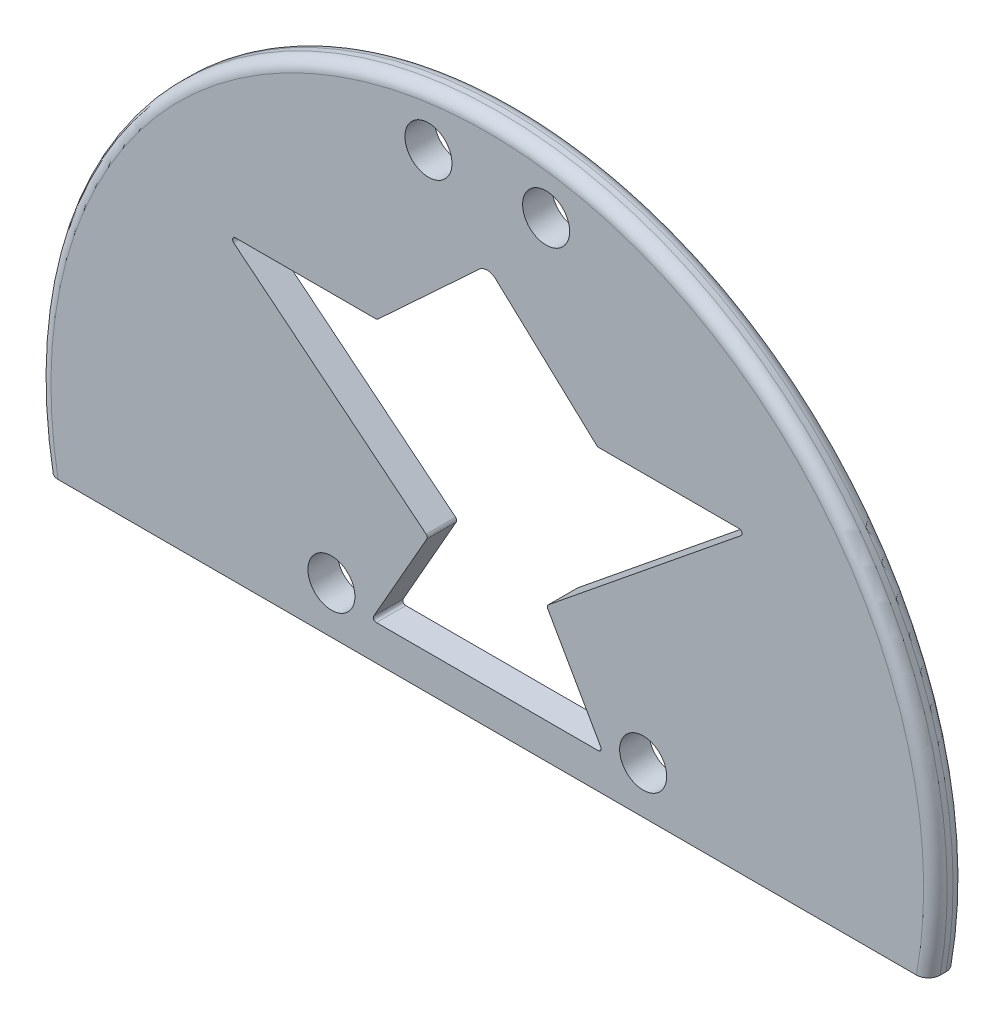
ISO-10303-21;
HEADER;
FILE_DESCRIPTION(('STEP AP214'),'2;1');
FILE_NAME('part.step','',(''),(''),'','','');
FILE_SCHEMA(('AUTOMOTIVE_DESIGN { 1 0 10303 214 1 1 1 1 }'));
ENDSEC;
DATA;
#1=APPLICATION_CONTEXT('core data for automotive mechanical design processes');
#2=APPLICATION_PROTOCOL_DEFINITION('international standard','automotive_design',2000,#1);
#3=PRODUCT_CONTEXT('',#1,'mechanical');
#4=PRODUCT('Part','Part','',(#3));
#5=PRODUCT_RELATED_PRODUCT_CATEGORY('part','',(#4));
#6=PRODUCT_DEFINITION_FORMATION('','',#4);
#7=PRODUCT_DEFINITION_CONTEXT('part definition',#1,'design');
#8=PRODUCT_DEFINITION('design','',#6,#7);
#9=PRODUCT_DEFINITION_SHAPE('','',#8);
#10=(LENGTH_UNIT() NAMED_UNIT(*) SI_UNIT(.MILLI.,.METRE.));
#11=(NAMED_UNIT(*) PLANE_ANGLE_UNIT() SI_UNIT($,.RADIAN.));
#12=(NAMED_UNIT(*) SI_UNIT($,.STERADIAN.) SOLID_ANGLE_UNIT());
#13=UNCERTAINTY_MEASURE_WITH_UNIT(LENGTH_MEASURE(1.E-05),#10,'distance_accuracy_value','');
#14=(GEOMETRIC_REPRESENTATION_CONTEXT(3) GLOBAL_UNCERTAINTY_ASSIGNED_CONTEXT((#13)) GLOBAL_UNIT_ASSIGNED_CONTEXT((#10,
#11,#12)) REPRESENTATION_CONTEXT('',''));
#15=CARTESIAN_POINT('',(0.,0.,0.));
#16=DIRECTION('',(0.,0.,1.));
#17=DIRECTION('',(1.,0.,0.));
#18=AXIS2_PLACEMENT_3D('',#15,#16,#17);
#19=CARTESIAN_POINT('',(0.,13.4283900967621,5.));
#20=DIRECTION('',(0.,0.,-1.));
#21=DIRECTION('',(-1.,0.,0.));
#22=AXIS2_PLACEMENT_3D('',#19,#20,#21);
#23=CYLINDRICAL_SURFACE('',#22,76.1926614615267);
#24=DIRECTION('',(0.,0.,-1.));
#25=VECTOR('',#24,1.);
#26=CARTESIAN_POINT('',(75.,0.,5.));
#27=LINE('',#26,#25);
#28=CARTESIAN_POINT('',(75.,0.,3.));
#29=VERTEX_POINT('',#28);
#30=CARTESIAN_POINT('',(75.,0.,2.));
#31=VERTEX_POINT('',#30);
#32=EDGE_CURVE('E373',#29,#31,#27,.T.);
#33=ORIENTED_EDGE('',*,*,#32,.T.);
#34=CARTESIAN_POINT('',(0.,13.4283900967621,2.));
#35=DIRECTION('',(0.,0.,-1.));
#36=DIRECTION('',(-1.,0.,0.));
#37=AXIS2_PLACEMENT_3D('',#34,#35,#36);
#38=CIRCLE('',#37,76.1926614615267);
#39=CARTESIAN_POINT('',(-75.,0.,2.));
#40=VERTEX_POINT('',#39);
#41=EDGE_CURVE('E383',#31,#40,#38,.F.);
#42=ORIENTED_EDGE('',*,*,#41,.T.);
#43=DIRECTION('',(0.,0.,-1.));
#44=VECTOR('',#43,1.);
#45=CARTESIAN_POINT('',(-75.,0.,5.));
#46=LINE('',#45,#44);
#47=CARTESIAN_POINT('',(-75.,0.,3.));
#48=VERTEX_POINT('',#47);
#49=EDGE_CURVE('E378',#48,#40,#46,.T.);
#50=ORIENTED_EDGE('',*,*,#49,.F.);
#51=CARTESIAN_POINT('',(0.,13.4283900967621,3.));
#52=DIRECTION('',(0.,0.,-1.));
#53=DIRECTION('',(-1.,0.,0.));
#54=AXIS2_PLACEMENT_3D('',#51,#52,#53);
#55=CIRCLE('',#54,76.1926614615267);
#56=EDGE_CURVE('E381',#48,#29,#55,.T.);
#57=ORIENTED_EDGE('',*,*,#56,.T.);
#58=EDGE_LOOP('',(#33,#42,#50,#57));
#59=FACE_BOUND('',#58,.T.);
#60=ADVANCED_FACE('F39',(#59),#23,.T.);
#61=CARTESIAN_POINT('',(-75.,0.,5.));
#62=DIRECTION('',(0.,1.,0.));
#63=DIRECTION('',(0.,0.,1.));
#64=AXIS2_PLACEMENT_3D('',#61,#62,#63);
#65=PLANE('',#64);
#66=ORIENTED_EDGE('',*,*,#49,.T.);
#67=CARTESIAN_POINT('',(-75.,0.,2.));
#68=CARTESIAN_POINT('',(-75.0000000807936,0.,1.94437473360322));
#69=CARTESIAN_POINT('',(-74.9976409515728,0.,1.88877633630942));
#70=CARTESIAN_POINT('',(-74.9882325002566,0.,1.77798223042784));
#71=CARTESIAN_POINT('',(-74.9811835466967,0.,1.72278649054299));
#72=CARTESIAN_POINT('',(-74.9530827056828,0.,1.55854129582627));
#73=CARTESIAN_POINT('',(-74.9250765649443,0.,1.45059985809138));
#74=CARTESIAN_POINT('',(-74.8513662576753,0.,1.24096661260589));
#75=CARTESIAN_POINT('',(-74.8056562414237,0.,1.13927688342937));
#76=CARTESIAN_POINT('',(-74.6979251702693,0.,0.944938573808043));
#77=CARTESIAN_POINT('',(-74.6359049956677,0.,0.852289505785434));
#78=CARTESIAN_POINT('',(-74.4969231902957,0.,0.677959777105565));
#79=CARTESIAN_POINT('',(-74.4198639810298,0.,0.596356984345373));
#80=CARTESIAN_POINT('',(-74.2533038272674,0.,0.447001640345716));
#81=CARTESIAN_POINT('',(-74.1638001730127,0.,0.379252113592567));
#82=CARTESIAN_POINT('',(-73.9734806801513,0.,0.258457536583111));
#83=CARTESIAN_POINT('',(-73.8725151149175,0.,0.20564865067165));
#84=CARTESIAN_POINT('',(-73.6632534202069,0.,0.11746849122814));
#85=CARTESIAN_POINT('',(-73.5549598844654,0.,0.0820910841624064));
#86=CARTESIAN_POINT('',(-73.3663898836883,0.,0.0372985743339663));
#87=CARTESIAN_POINT('',(-73.2871650798922,0.,0.0233190325615237));
#88=CARTESIAN_POINT('',(-73.1277417984286,0.,0.0046701170815256));
#89=CARTESIAN_POINT('',(-73.0475448701878,0.,-1.25034629829377E-05));
#90=CARTESIAN_POINT('',(-72.967317027241,0.,0.));
#91=B_SPLINE_CURVE_WITH_KNOTS('',3,(#67,#68,#69,#70,#71,#72,#73,#74,#75,#76,#77,#78,#79,#80,#81,
#82,#83,#84,#85,#86,#87,#88,#89,#90),.UNSPECIFIED.,.F.,.F.,(4,2,2,2,2,2,2,2,2,2,2,4),(0.,
0.166772542538005,0.333531981314523,0.666357835634245,0.999293756342944,1.33221171133097,
1.66736622938711,2.00259384143326,2.34285694844844,2.68300024300966,2.92383033004541,
3.16431702028172),.UNSPECIFIED.);
#92=CARTESIAN_POINT('',(-72.967317027241,0.,0.));
#93=VERTEX_POINT('',#92);
#94=EDGE_CURVE('E413',#40,#93,#91,.T.);
#95=ORIENTED_EDGE('',*,*,#94,.T.);
#96=DIRECTION('',(1.,0.,0.));
#97=VECTOR('',#96,1.);
#98=CARTESIAN_POINT('',(-75.,0.,0.));
#99=LINE('',#98,#97);
#100=CARTESIAN_POINT('',(72.967317027241,0.,0.));
#101=VERTEX_POINT('',#100);
#102=EDGE_CURVE('E350',#93,#101,#99,.T.);
#103=ORIENTED_EDGE('',*,*,#102,.T.);
#104=CARTESIAN_POINT('',(72.967317027241,0.,0.));
#105=CARTESIAN_POINT('',(73.0252058663371,0.,8.94658172851899E-07));
#106=CARTESIAN_POINT('',(73.0830672872238,0.,0.0024324924788198));
#107=CARTESIAN_POINT('',(73.1983818272335,0.,0.012137730152485));
#108=CARTESIAN_POINT('',(73.255834950811,0.,0.0194113170974663));
#109=CARTESIAN_POINT('',(73.4269214130844,0.,0.0484436659315943));
#110=CARTESIAN_POINT('',(73.5394175423327,0.,0.0774141203938929));
#111=CARTESIAN_POINT('',(73.7579583662471,0.,0.153869250513778));
#112=CARTESIAN_POINT('',(73.8639987336327,0.,0.201366189848063));
#113=CARTESIAN_POINT('',(74.066497163907,0.,0.313619524621708));
#114=CARTESIAN_POINT('',(74.1629582935991,0.,0.378370371591788));
#115=CARTESIAN_POINT('',(74.342697243322,0.,0.522797535821646));
#116=CARTESIAN_POINT('',(74.4260745825831,0.,0.602349994919452));
#117=CARTESIAN_POINT('',(74.5780538956178,0.,0.774542249128223));
#118=CARTESIAN_POINT('',(74.6466534703985,0.,0.867184165119394));
#119=CARTESIAN_POINT('',(74.7659798335164,0.,1.06137723220373));
#120=CARTESIAN_POINT('',(74.8169636488227,0.,1.16277065950621));
#121=CARTESIAN_POINT('',(74.9008756599046,0.,1.37273300241403));
#122=CARTESIAN_POINT('',(74.9338185752605,0.,1.48129598707995));
#123=CARTESIAN_POINT('',(74.9714465993115,0.,1.65890185858043));
#124=CARTESIAN_POINT('',(74.9821480681298,0.,1.72672712899801));
#125=CARTESIAN_POINT('',(74.9964228577847,0.,1.86302440380287));
#126=CARTESIAN_POINT('',(75.0000064482573,0.,1.93149533301149));
#127=CARTESIAN_POINT('',(75.,0.,2.));
#128=B_SPLINE_CURVE_WITH_KNOTS('',3,(#104,#105,#106,#107,#108,#109,#110,#111,#112,#113,#114,
#115,#116,#117,#118,#119,#120,#121,#122,#123,#124,#125,#126,#127),.UNSPECIFIED.,.F.,.F.,(4,2,2,
2,2,2,2,2,2,2,2,4),(0.,0.17356080760957,0.347119718764882,0.69383558549081,1.040781352658,
1.38761568422101,1.73166859802616,2.07577732267278,2.41462921521817,2.75320422484968,
2.95885559472801,3.16421003578057),.UNSPECIFIED.);
#129=EDGE_CURVE('E408',#101,#31,#128,.T.);
#130=ORIENTED_EDGE('',*,*,#129,.T.);
#131=ORIENTED_EDGE('',*,*,#32,.F.);
#132=CARTESIAN_POINT('',(75.,0.,3.));
#133=CARTESIAN_POINT('',(75.0000000807936,0.,3.05562526639678));
#134=CARTESIAN_POINT('',(74.9976409515728,0.,3.11122366369058));
#135=CARTESIAN_POINT('',(74.9882325002566,0.,3.22201776957216));
#136=CARTESIAN_POINT('',(74.9811835466967,0.,3.27721350945701));
#137=CARTESIAN_POINT('',(74.9530827056828,0.,3.44145870417373));
#138=CARTESIAN_POINT('',(74.9250765649443,0.,3.54940014190862));
#139=CARTESIAN_POINT('',(74.8513662576753,0.,3.75903338739411));
#140=CARTESIAN_POINT('',(74.8056562414237,0.,3.86072311657063));
#141=CARTESIAN_POINT('',(74.6979251702693,0.,4.05506142619196));
#142=CARTESIAN_POINT('',(74.6359049956677,0.,4.14771049421457));
#143=CARTESIAN_POINT('',(74.4969231902957,0.,4.32204022289444));
#144=CARTESIAN_POINT('',(74.4198639810298,0.,4.40364301565463));
#145=CARTESIAN_POINT('',(74.2533038272674,0.,4.55299835965428));
#146=CARTESIAN_POINT('',(74.1638001730127,0.,4.62074788640743));
#147=CARTESIAN_POINT('',(73.9734806801513,0.,4.74154246341689));
#148=CARTESIAN_POINT('',(73.8725151149175,0.,4.79435134932835));
#149=CARTESIAN_POINT('',(73.6632534202069,0.,4.88253150877186));
#150=CARTESIAN_POINT('',(73.5549598844654,0.,4.91790891583759));
#151=CARTESIAN_POINT('',(73.3663898836883,0.,4.96270142566603));
#152=CARTESIAN_POINT('',(73.2871650798922,0.,4.97668096743848));
#153=CARTESIAN_POINT('',(73.1277417984286,0.,4.99532988291847));
#154=CARTESIAN_POINT('',(73.0475448701878,0.,5.00001250346298));
#155=CARTESIAN_POINT('',(72.967317027241,0.,5.));
#156=B_SPLINE_CURVE_WITH_KNOTS('',3,(#132,#133,#134,#135,#136,#137,#138,#139,#140,#141,#142,
#143,#144,#145,#146,#147,#148,#149,#150,#151,#152,#153,#154,#155),.UNSPECIFIED.,.F.,.F.,(4,2,2,
2,2,2,2,2,2,2,2,4),(0.,0.166772542538005,0.333531981314524,0.666357835634245,0.999293756342944,
1.33221171133097,1.66736622938711,2.00259384143326,2.34285694844844,2.68300024300966,
2.92383033004541,3.16431702028172),.UNSPECIFIED.);
#157=CARTESIAN_POINT('',(72.967317027241,0.,5.));
#158=VERTEX_POINT('',#157);
#159=EDGE_CURVE('E55',#29,#158,#156,.T.);
#160=ORIENTED_EDGE('',*,*,#159,.T.);
#161=DIRECTION('',(1.,0.,0.));
#162=VECTOR('',#161,1.);
#163=CARTESIAN_POINT('',(-75.,0.,5.));
#164=LINE('',#163,#162);
#165=CARTESIAN_POINT('',(-72.967317027241,0.,5.));
#166=VERTEX_POINT('',#165);
#167=EDGE_CURVE('E371',#166,#158,#164,.T.);
#168=ORIENTED_EDGE('',*,*,#167,.F.);
#169=CARTESIAN_POINT('',(-72.967317027241,0.,5.));
#170=CARTESIAN_POINT('',(-73.0252058663371,0.,4.99999910534183));
#171=CARTESIAN_POINT('',(-73.0830672872238,0.,4.99756750752118));
#172=CARTESIAN_POINT('',(-73.1983818272335,0.,4.98786226984751));
#173=CARTESIAN_POINT('',(-73.255834950811,0.,4.98058868290253));
#174=CARTESIAN_POINT('',(-73.4269214130844,0.,4.95155633406841));
#175=CARTESIAN_POINT('',(-73.5394175423327,0.,4.92258587960611));
#176=CARTESIAN_POINT('',(-73.7579583662471,0.,4.84613074948622));
#177=CARTESIAN_POINT('',(-73.8639987336327,0.,4.79863381015194));
#178=CARTESIAN_POINT('',(-74.066497163907,0.,4.6863804753783));
#179=CARTESIAN_POINT('',(-74.1629582935991,0.,4.62162962840822));
#180=CARTESIAN_POINT('',(-74.342697243322,0.,4.47720246417836));
#181=CARTESIAN_POINT('',(-74.4260745825831,0.,4.39765000508055));
#182=CARTESIAN_POINT('',(-74.5780538956178,0.,4.22545775087178));
#183=CARTESIAN_POINT('',(-74.6466534703985,0.,4.13281583488061));
#184=CARTESIAN_POINT('',(-74.7659798335164,0.,3.93862276779627));
#185=CARTESIAN_POINT('',(-74.8169636488227,0.,3.83722934049379));
#186=CARTESIAN_POINT('',(-74.9008756599046,0.,3.62726699758597));
#187=CARTESIAN_POINT('',(-74.9338185752605,0.,3.51870401292005));
#188=CARTESIAN_POINT('',(-74.9714465993115,0.,3.34109814141957));
#189=CARTESIAN_POINT('',(-74.9821480681298,0.,3.27327287100199));
#190=CARTESIAN_POINT('',(-74.9964228577847,0.,3.13697559619713));
#191=CARTESIAN_POINT('',(-75.0000064482573,0.,3.06850466698851));
#192=CARTESIAN_POINT('',(-75.,0.,3.));
#193=B_SPLINE_CURVE_WITH_KNOTS('',3,(#169,#170,#171,#172,#173,#174,#175,#176,#177,#178,#179,
#180,#181,#182,#183,#184,#185,#186,#187,#188,#189,#190,#191,#192),.UNSPECIFIED.,.F.,.F.,(4,2,2,
2,2,2,2,2,2,2,2,4),(0.,0.17356080760957,0.347119718764882,0.693835585490809,1.040781352658,
1.38761568422099,1.73166859802616,2.07577732267278,2.41462921521818,2.75320422484968,
2.95885559472802,3.16421003578057),.UNSPECIFIED.);
#194=EDGE_CURVE('E63',#166,#48,#193,.T.);
#195=ORIENTED_EDGE('',*,*,#194,.T.);
#196=EDGE_LOOP('',(#66,#95,#103,#130,#131,#160,#168,#195));
#197=FACE_BOUND('',#196,.T.);
#198=ADVANCED_FACE('F397',(#197),#65,.F.);
#199=CARTESIAN_POINT('',(0.,13.4283900967621,5.));
#200=DIRECTION('',(0.,0.,-1.));
#201=DIRECTION('',(-1.,0.,0.));
#202=AXIS2_PLACEMENT_3D('',#199,#200,#201);
#203=PLANE('',#202);
#204=DIRECTION('',(-1.,0.,0.));
#205=VECTOR('',#204,1.);
#206=CARTESIAN_POINT('',(-42.8034018001975,50.6674536340166,5.));
#207=LINE('',#206,#205);
#208=CARTESIAN_POINT('',(-18.9455402336368,50.6674536340166,5.));
#209=VERTEX_POINT('',#208);
#210=CARTESIAN_POINT('',(-42.8034018001975,50.6674536340166,5.));
#211=VERTEX_POINT('',#210);
#212=EDGE_CURVE('E267',#209,#211,#207,.T.);
#213=ORIENTED_EDGE('',*,*,#212,.F.);
#214=CARTESIAN_POINT('',(-18.9455402336368,51.1674536340166,5.));
#215=DIRECTION('',(0.,0.,-1.));
#216=DIRECTION('',(1.,0.,0.));
#217=AXIS2_PLACEMENT_3D('',#214,#215,#216);
#218=CIRCLE('',#217,0.499999999999991);
#219=CARTESIAN_POINT('',(-18.6057993792613,50.8006074102821,5.));
#220=VERTEX_POINT('',#219);
#221=EDGE_CURVE('E198',#220,#209,#218,.T.);
#222=ORIENTED_EDGE('',*,*,#221,.F.);
#223=DIRECTION('',(-0.73369244746886,-0.679481708750981,0.));
#224=VECTOR('',#223,1.);
#225=CARTESIAN_POINT('',(-18.6057993792613,50.8006074102821,5.));
#226=LINE('',#225,#224);
#227=CARTESIAN_POINT('',(-1.35896341750195,66.7731168865249,5.));
#228=VERTEX_POINT('',#227);
#229=EDGE_CURVE('E217',#228,#220,#226,.T.);
#230=ORIENTED_EDGE('',*,*,#229,.F.);
#231=CARTESIAN_POINT('',(0.,65.3057319915872,5.));
#232=DIRECTION('',(0.,0.,1.));
#233=DIRECTION('',(-1.,0.,0.));
#234=AXIS2_PLACEMENT_3D('',#231,#232,#233);
#235=CIRCLE('',#234,1.99999999999998);
#236=CARTESIAN_POINT('',(1.35896341750195,66.7731168865249,5.));
#237=VERTEX_POINT('',#236);
#238=EDGE_CURVE('E220',#237,#228,#235,.T.);
#239=ORIENTED_EDGE('',*,*,#238,.F.);
#240=DIRECTION('',(-0.73369244746886,0.679481708750981,0.));
#241=VECTOR('',#240,1.);
#242=CARTESIAN_POINT('',(18.6057993792613,50.8006074102821,5.));
#243=LINE('',#242,#241);
#244=CARTESIAN_POINT('',(18.6057993792613,50.8006074102821,5.));
#245=VERTEX_POINT('',#244);
#246=EDGE_CURVE('E308',#245,#237,#243,.T.);
#247=ORIENTED_EDGE('',*,*,#246,.F.);
#248=CARTESIAN_POINT('',(18.9455402336368,51.1674536340166,5.));
#249=DIRECTION('',(0.,0.,-1.));
#250=DIRECTION('',(-1.,0.,0.));
#251=AXIS2_PLACEMENT_3D('',#248,#249,#250);
#252=CIRCLE('',#251,0.499999999999991);
#253=CARTESIAN_POINT('',(18.9455402336368,50.6674536340166,5.));
#254=VERTEX_POINT('',#253);
#255=EDGE_CURVE('E305',#254,#245,#252,.T.);
#256=ORIENTED_EDGE('',*,*,#255,.F.);
#257=DIRECTION('',(-1.,0.,0.));
#258=VECTOR('',#257,1.);
#259=CARTESIAN_POINT('',(42.8034018001975,50.6674536340166,5.));
#260=LINE('',#259,#258);
#261=CARTESIAN_POINT('',(42.8034018001975,50.6674536340165,5.));
#262=VERTEX_POINT('',#261);
#263=EDGE_CURVE('E302',#262,#254,#260,.T.);
#264=ORIENTED_EDGE('',*,*,#263,.F.);
#265=CARTESIAN_POINT('',(42.8034018001975,50.1674536340165,5.));
#266=DIRECTION('',(0.,0.,1.));
#267=DIRECTION('',(1.,0.,0.));
#268=AXIS2_PLACEMENT_3D('',#265,#266,#267);
#269=CIRCLE('',#268,0.500000000000004);
#270=CARTESIAN_POINT('',(43.1183027794081,49.7790757596568,5.));
#271=VERTEX_POINT('',#270);
#272=EDGE_CURVE('E299',#271,#262,#269,.T.);
#273=ORIENTED_EDGE('',*,*,#272,.F.);
#274=DIRECTION('',(0.776755748719506,0.629801958421216,0.));
#275=VECTOR('',#274,1.);
#276=CARTESIAN_POINT('',(10.3870609475926,23.240231031158,5.));
#277=LINE('',#276,#275);
#278=CARTESIAN_POINT('',(10.3870609475926,23.240231031158,5.));
#279=VERTEX_POINT('',#278);
#280=EDGE_CURVE('E296',#279,#271,#277,.T.);
#281=ORIENTED_EDGE('',*,*,#280,.F.);
#282=CARTESIAN_POINT('',(10.7019619268032,22.8518531567982,5.));
#283=DIRECTION('',(0.,0.,-1.));
#284=DIRECTION('',(-1.,0.,0.));
#285=AXIS2_PLACEMENT_3D('',#282,#283,#284);
#286=CIRCLE('',#285,0.499999999999995);
#287=CARTESIAN_POINT('',(10.2675082132739,22.6043658423748,5.));
#288=VERTEX_POINT('',#287);
#289=EDGE_CURVE('E293',#288,#279,#286,.T.);
#290=ORIENTED_EDGE('',*,*,#289,.F.);
#291=DIRECTION('',(-0.494974628846904,0.868907427058757,0.));
#292=VECTOR('',#291,1.);
#293=CARTESIAN_POINT('',(19.3023212585952,6.74412634796789,5.));
#294=LINE('',#293,#292);
#295=CARTESIAN_POINT('',(19.3023212585952,6.74412634796789,5.));
#296=VERTEX_POINT('',#295);
#297=EDGE_CURVE('E290',#296,#288,#294,.T.);
#298=ORIENTED_EDGE('',*,*,#297,.F.);
#299=CARTESIAN_POINT('',(18.8678675450658,6.49663903354443,5.));
#300=DIRECTION('',(0.,0.,1.));
#301=DIRECTION('',(1.,0.,0.));
#302=AXIS2_PLACEMENT_3D('',#299,#300,#301);
#303=CIRCLE('',#302,0.500000000000005);
#304=CARTESIAN_POINT('',(18.8678675450658,5.99663903354443,5.));
#305=VERTEX_POINT('',#304);
#306=EDGE_CURVE('E287',#305,#296,#303,.T.);
#307=ORIENTED_EDGE('',*,*,#306,.F.);
#308=DIRECTION('',(1.,0.,0.));
#309=VECTOR('',#308,1.);
#310=CARTESIAN_POINT('',(18.8678675450658,5.99663903354443,5.));
#311=LINE('',#310,#309);
#312=CARTESIAN_POINT('',(-18.8678675450658,5.99663903354443,5.));
#313=VERTEX_POINT('',#312);
#314=EDGE_CURVE('E284',#313,#305,#311,.T.);
#315=ORIENTED_EDGE('',*,*,#314,.F.);
#316=CARTESIAN_POINT('',(-18.8678675450658,6.49663903354443,5.));
#317=DIRECTION('',(0.,0.,1.));
#318=DIRECTION('',(-1.,0.,0.));
#319=AXIS2_PLACEMENT_3D('',#316,#317,#318);
#320=CIRCLE('',#319,0.500000000000005);
#321=CARTESIAN_POINT('',(-19.3023212585952,6.74412634796789,5.));
#322=VERTEX_POINT('',#321);
#323=EDGE_CURVE('E281',#322,#313,#320,.T.);
#324=ORIENTED_EDGE('',*,*,#323,.F.);
#325=DIRECTION('',(-0.494974628846904,-0.868907427058757,0.));
#326=VECTOR('',#325,1.);
#327=CARTESIAN_POINT('',(-19.3023212585952,6.74412634796789,5.));
#328=LINE('',#327,#326);
#329=CARTESIAN_POINT('',(-10.2675082132739,22.6043658423748,5.));
#330=VERTEX_POINT('',#329);
#331=EDGE_CURVE('E278',#330,#322,#328,.T.);
#332=ORIENTED_EDGE('',*,*,#331,.F.);
#333=CARTESIAN_POINT('',(-10.7019619268032,22.8518531567982,5.));
#334=DIRECTION('',(0.,0.,-1.));
#335=DIRECTION('',(1.,0.,0.));
#336=AXIS2_PLACEMENT_3D('',#333,#334,#335);
#337=CIRCLE('',#336,0.499999999999995);
#338=CARTESIAN_POINT('',(-10.3870609475926,23.240231031158,5.));
#339=VERTEX_POINT('',#338);
#340=EDGE_CURVE('E275',#339,#330,#337,.T.);
#341=ORIENTED_EDGE('',*,*,#340,.F.);
#342=DIRECTION('',(0.776755748719506,-0.629801958421216,0.));
#343=VECTOR('',#342,1.);
#344=CARTESIAN_POINT('',(-10.3870609475926,23.240231031158,5.));
#345=LINE('',#344,#343);
#346=CARTESIAN_POINT('',(-43.1183027794081,49.7790757596568,5.));
#347=VERTEX_POINT('',#346);
#348=EDGE_CURVE('E272',#347,#339,#345,.T.);
#349=ORIENTED_EDGE('',*,*,#348,.F.);
#350=CARTESIAN_POINT('',(-42.8034018001975,50.1674536340165,5.));
#351=DIRECTION('',(0.,0.,1.));
#352=DIRECTION('',(-1.,0.,0.));
#353=AXIS2_PLACEMENT_3D('',#350,#351,#352);
#354=CIRCLE('',#353,0.500000000000004);
#355=EDGE_CURVE('E269',#211,#347,#354,.T.);
#356=ORIENTED_EDGE('',*,*,#355,.F.);
#357=EDGE_LOOP('',(#213,#222,#230,#239,#247,#256,#264,#273,#281,#290,#298,#307,#315,#324,#332,
#341,#349,#356));
#358=FACE_BOUND('',#357,.T.);
#359=CARTESIAN_POINT('',(26.5,7.99999999999999,5.));
#360=DIRECTION('',(0.,0.,1.));
#361=DIRECTION('',(1.,0.,0.));
#362=AXIS2_PLACEMENT_3D('',#359,#360,#361);
#363=CIRCLE('',#362,4.);
#364=CARTESIAN_POINT('',(30.5,7.99999999999999,5.));
#365=VERTEX_POINT('',#364);
#366=EDGE_CURVE('E351',#365,#365,#363,.T.);
#367=ORIENTED_EDGE('',*,*,#366,.F.);
#368=EDGE_LOOP('',(#367));
#369=FACE_BOUND('',#368,.T.);
#370=CARTESIAN_POINT('',(10.,80.,5.));
#371=DIRECTION('',(0.,0.,1.));
#372=DIRECTION('',(1.,0.,0.));
#373=AXIS2_PLACEMENT_3D('',#370,#371,#372);
#374=CIRCLE('',#373,4.00000000000001);
#375=CARTESIAN_POINT('',(14.,80.,5.));
#376=VERTEX_POINT('',#375);
#377=EDGE_CURVE('E357',#376,#376,#374,.T.);
#378=ORIENTED_EDGE('',*,*,#377,.F.);
#379=EDGE_LOOP('',(#378));
#380=FACE_BOUND('',#379,.T.);
#381=CARTESIAN_POINT('',(-10.,80.,5.));
#382=DIRECTION('',(0.,0.,1.));
#383=DIRECTION('',(-1.,0.,0.));
#384=AXIS2_PLACEMENT_3D('',#381,#382,#383);
#385=CIRCLE('',#384,4.00000000000001);
#386=CARTESIAN_POINT('',(-14.,80.,5.));
#387=VERTEX_POINT('',#386);
#388=EDGE_CURVE('E363',#387,#387,#385,.T.);
#389=ORIENTED_EDGE('',*,*,#388,.F.);
#390=EDGE_LOOP('',(#389));
#391=FACE_BOUND('',#390,.T.);
#392=CARTESIAN_POINT('',(-26.5,7.99999999999998,5.));
#393=DIRECTION('',(0.,0.,1.));
#394=DIRECTION('',(-1.,0.,0.));
#395=AXIS2_PLACEMENT_3D('',#392,#393,#394);
#396=CIRCLE('',#395,4.);
#397=CARTESIAN_POINT('',(-30.5,7.99999999999998,5.));
#398=VERTEX_POINT('',#397);
#399=EDGE_CURVE('E315',#398,#398,#396,.T.);
#400=ORIENTED_EDGE('',*,*,#399,.F.);
#401=EDGE_LOOP('',(#400));
#402=FACE_BOUND('',#401,.T.);
#403=ORIENTED_EDGE('',*,*,#167,.T.);
#404=CARTESIAN_POINT('',(0.,13.4283900967621,5.));
#405=DIRECTION('',(0.,0.,-1.));
#406=DIRECTION('',(-1.,0.,0.));
#407=AXIS2_PLACEMENT_3D('',#404,#405,#406);
#408=CIRCLE('',#407,74.1926614615267);
#409=EDGE_CURVE('E11',#158,#166,#408,.F.);
#410=ORIENTED_EDGE('',*,*,#409,.T.);
#411=EDGE_LOOP('',(#403,#410));
#412=FACE_BOUND('',#411,.T.);
#413=ADVANCED_FACE('F402',(#358,#369,#380,#391,#402,#412),#203,.F.);
#414=CARTESIAN_POINT('',(0.,13.4283900967621,0.));
#415=DIRECTION('',(0.,0.,-1.));
#416=DIRECTION('',(-1.,0.,0.));
#417=AXIS2_PLACEMENT_3D('',#414,#415,#416);
#418=PLANE('',#417);
#419=CARTESIAN_POINT('',(-18.9455402336368,51.1674536340166,0.));
#420=DIRECTION('',(0.,0.,-1.));
#421=DIRECTION('',(1.,0.,0.));
#422=AXIS2_PLACEMENT_3D('',#419,#420,#421);
#423=CIRCLE('',#422,0.499999999999991);
#424=CARTESIAN_POINT('',(-18.6057993792613,50.8006074102821,0.));
#425=VERTEX_POINT('',#424);
#426=CARTESIAN_POINT('',(-18.9455402336368,50.6674536340166,0.));
#427=VERTEX_POINT('',#426);
#428=EDGE_CURVE('E195',#425,#427,#423,.T.);
#429=ORIENTED_EDGE('',*,*,#428,.T.);
#430=DIRECTION('',(-1.,0.,0.));
#431=VECTOR('',#430,1.);
#432=CARTESIAN_POINT('',(-42.8034018001975,50.6674536340166,0.));
#433=LINE('',#432,#431);
#434=CARTESIAN_POINT('',(-42.8034018001975,50.6674536340166,0.));
#435=VERTEX_POINT('',#434);
#436=EDGE_CURVE('E207',#427,#435,#433,.T.);
#437=ORIENTED_EDGE('',*,*,#436,.T.);
#438=CARTESIAN_POINT('',(-42.8034018001975,50.1674536340165,0.));
#439=DIRECTION('',(0.,0.,1.));
#440=DIRECTION('',(-1.,0.,0.));
#441=AXIS2_PLACEMENT_3D('',#438,#439,#440);
#442=CIRCLE('',#441,0.500000000000004);
#443=CARTESIAN_POINT('',(-43.1183027794081,49.7790757596568,0.));
#444=VERTEX_POINT('',#443);
#445=EDGE_CURVE('E211',#435,#444,#442,.T.);
#446=ORIENTED_EDGE('',*,*,#445,.T.);
#447=DIRECTION('',(0.776755748719506,-0.629801958421216,0.));
#448=VECTOR('',#447,1.);
#449=CARTESIAN_POINT('',(-10.3870609475926,23.240231031158,0.));
#450=LINE('',#449,#448);
#451=CARTESIAN_POINT('',(-10.3870609475926,23.240231031158,0.));
#452=VERTEX_POINT('',#451);
#453=EDGE_CURVE('E224',#444,#452,#450,.T.);
#454=ORIENTED_EDGE('',*,*,#453,.T.);
#455=CARTESIAN_POINT('',(-10.7019619268032,22.8518531567982,0.));
#456=DIRECTION('',(0.,0.,-1.));
#457=DIRECTION('',(1.,0.,0.));
#458=AXIS2_PLACEMENT_3D('',#455,#456,#457);
#459=CIRCLE('',#458,0.499999999999995);
#460=CARTESIAN_POINT('',(-10.2675082132739,22.6043658423748,0.));
#461=VERTEX_POINT('',#460);
#462=EDGE_CURVE('E227',#452,#461,#459,.T.);
#463=ORIENTED_EDGE('',*,*,#462,.T.);
#464=DIRECTION('',(-0.494974628846904,-0.868907427058757,0.));
#465=VECTOR('',#464,1.);
#466=CARTESIAN_POINT('',(-19.3023212585952,6.74412634796789,0.));
#467=LINE('',#466,#465);
#468=CARTESIAN_POINT('',(-19.3023212585952,6.74412634796789,0.));
#469=VERTEX_POINT('',#468);
#470=EDGE_CURVE('E230',#461,#469,#467,.T.);
#471=ORIENTED_EDGE('',*,*,#470,.T.);
#472=CARTESIAN_POINT('',(-18.8678675450658,6.49663903354443,0.));
#473=DIRECTION('',(0.,0.,1.));
#474=DIRECTION('',(-1.,0.,0.));
#475=AXIS2_PLACEMENT_3D('',#472,#473,#474);
#476=CIRCLE('',#475,0.500000000000005);
#477=CARTESIAN_POINT('',(-18.8678675450658,5.99663903354443,0.));
#478=VERTEX_POINT('',#477);
#479=EDGE_CURVE('E233',#469,#478,#476,.T.);
#480=ORIENTED_EDGE('',*,*,#479,.T.);
#481=DIRECTION('',(1.,0.,0.));
#482=VECTOR('',#481,1.);
#483=CARTESIAN_POINT('',(18.8678675450658,5.99663903354443,0.));
#484=LINE('',#483,#482);
#485=CARTESIAN_POINT('',(18.8678675450658,5.99663903354443,0.));
#486=VERTEX_POINT('',#485);
#487=EDGE_CURVE('E236',#478,#486,#484,.T.);
#488=ORIENTED_EDGE('',*,*,#487,.T.);
#489=CARTESIAN_POINT('',(18.8678675450658,6.49663903354443,0.));
#490=DIRECTION('',(0.,0.,1.));
#491=DIRECTION('',(1.,0.,0.));
#492=AXIS2_PLACEMENT_3D('',#489,#490,#491);
#493=CIRCLE('',#492,0.500000000000005);
#494=CARTESIAN_POINT('',(19.3023212585952,6.74412634796789,0.));
#495=VERTEX_POINT('',#494);
#496=EDGE_CURVE('E239',#486,#495,#493,.T.);
#497=ORIENTED_EDGE('',*,*,#496,.T.);
#498=DIRECTION('',(-0.494974628846904,0.868907427058757,0.));
#499=VECTOR('',#498,1.);
#500=CARTESIAN_POINT('',(19.3023212585952,6.74412634796789,0.));
#501=LINE('',#500,#499);
#502=CARTESIAN_POINT('',(10.2675082132739,22.6043658423748,0.));
#503=VERTEX_POINT('',#502);
#504=EDGE_CURVE('E242',#495,#503,#501,.T.);
#505=ORIENTED_EDGE('',*,*,#504,.T.);
#506=CARTESIAN_POINT('',(10.7019619268032,22.8518531567982,0.));
#507=DIRECTION('',(0.,0.,-1.));
#508=DIRECTION('',(-1.,0.,0.));
#509=AXIS2_PLACEMENT_3D('',#506,#507,#508);
#510=CIRCLE('',#509,0.499999999999995);
#511=CARTESIAN_POINT('',(10.3870609475926,23.240231031158,0.));
#512=VERTEX_POINT('',#511);
#513=EDGE_CURVE('E245',#503,#512,#510,.T.);
#514=ORIENTED_EDGE('',*,*,#513,.T.);
#515=DIRECTION('',(0.776755748719506,0.629801958421216,0.));
#516=VECTOR('',#515,1.);
#517=CARTESIAN_POINT('',(10.3870609475926,23.240231031158,0.));
#518=LINE('',#517,#516);
#519=CARTESIAN_POINT('',(43.1183027794081,49.7790757596568,0.));
#520=VERTEX_POINT('',#519);
#521=EDGE_CURVE('E248',#512,#520,#518,.T.);
#522=ORIENTED_EDGE('',*,*,#521,.T.);
#523=CARTESIAN_POINT('',(42.8034018001975,50.1674536340165,0.));
#524=DIRECTION('',(0.,0.,1.));
#525=DIRECTION('',(1.,0.,0.));
#526=AXIS2_PLACEMENT_3D('',#523,#524,#525);
#527=CIRCLE('',#526,0.500000000000004);
#528=CARTESIAN_POINT('',(42.8034018001975,50.6674536340165,0.));
#529=VERTEX_POINT('',#528);
#530=EDGE_CURVE('E251',#520,#529,#527,.T.);
#531=ORIENTED_EDGE('',*,*,#530,.T.);
#532=DIRECTION('',(-1.,0.,0.));
#533=VECTOR('',#532,1.);
#534=CARTESIAN_POINT('',(42.8034018001975,50.6674536340166,0.));
#535=LINE('',#534,#533);
#536=CARTESIAN_POINT('',(18.9455402336368,50.6674536340166,0.));
#537=VERTEX_POINT('',#536);
#538=EDGE_CURVE('E254',#529,#537,#535,.T.);
#539=ORIENTED_EDGE('',*,*,#538,.T.);
#540=CARTESIAN_POINT('',(18.9455402336368,51.1674536340166,0.));
#541=DIRECTION('',(0.,0.,-1.));
#542=DIRECTION('',(-1.,0.,0.));
#543=AXIS2_PLACEMENT_3D('',#540,#541,#542);
#544=CIRCLE('',#543,0.499999999999991);
#545=CARTESIAN_POINT('',(18.6057993792613,50.8006074102821,0.));
#546=VERTEX_POINT('',#545);
#547=EDGE_CURVE('E257',#537,#546,#544,.T.);
#548=ORIENTED_EDGE('',*,*,#547,.T.);
#549=DIRECTION('',(-0.73369244746886,0.679481708750981,0.));
#550=VECTOR('',#549,1.);
#551=CARTESIAN_POINT('',(18.6057993792613,50.8006074102821,0.));
#552=LINE('',#551,#550);
#553=CARTESIAN_POINT('',(1.35896341750195,66.7731168865249,0.));
#554=VERTEX_POINT('',#553);
#555=EDGE_CURVE('E260',#546,#554,#552,.T.);
#556=ORIENTED_EDGE('',*,*,#555,.T.);
#557=CARTESIAN_POINT('',(0.,65.3057319915872,0.));
#558=DIRECTION('',(0.,0.,1.));
#559=DIRECTION('',(-1.,0.,0.));
#560=AXIS2_PLACEMENT_3D('',#557,#558,#559);
#561=CIRCLE('',#560,1.99999999999998);
#562=CARTESIAN_POINT('',(-1.35896341750195,66.7731168865249,0.));
#563=VERTEX_POINT('',#562);
#564=EDGE_CURVE('E263',#554,#563,#561,.T.);
#565=ORIENTED_EDGE('',*,*,#564,.T.);
#566=DIRECTION('',(-0.73369244746886,-0.679481708750981,0.));
#567=VECTOR('',#566,1.);
#568=CARTESIAN_POINT('',(-18.6057993792613,50.8006074102821,0.));
#569=LINE('',#568,#567);
#570=EDGE_CURVE('E203',#563,#425,#569,.T.);
#571=ORIENTED_EDGE('',*,*,#570,.T.);
#572=EDGE_LOOP('',(#429,#437,#446,#454,#463,#471,#480,#488,#497,#505,#514,#522,#531,#539,#548,
#556,#565,#571));
#573=FACE_BOUND('',#572,.T.);
#574=CARTESIAN_POINT('',(26.5,7.99999999999999,0.));
#575=DIRECTION('',(0.,0.,1.));
#576=DIRECTION('',(1.,0.,0.));
#577=AXIS2_PLACEMENT_3D('',#574,#575,#576);
#578=CIRCLE('',#577,4.);
#579=CARTESIAN_POINT('',(30.5,7.99999999999999,0.));
#580=VERTEX_POINT('',#579);
#581=EDGE_CURVE('E347',#580,#580,#578,.T.);
#582=ORIENTED_EDGE('',*,*,#581,.T.);
#583=EDGE_LOOP('',(#582));
#584=FACE_BOUND('',#583,.T.);
#585=CARTESIAN_POINT('',(10.,80.,0.));
#586=DIRECTION('',(0.,0.,1.));
#587=DIRECTION('',(1.,0.,0.));
#588=AXIS2_PLACEMENT_3D('',#585,#586,#587);
#589=CIRCLE('',#588,4.00000000000001);
#590=CARTESIAN_POINT('',(14.,80.,0.));
#591=VERTEX_POINT('',#590);
#592=EDGE_CURVE('E354',#591,#591,#589,.T.);
#593=ORIENTED_EDGE('',*,*,#592,.T.);
#594=EDGE_LOOP('',(#593));
#595=FACE_BOUND('',#594,.T.);
#596=CARTESIAN_POINT('',(-10.,80.,0.));
#597=DIRECTION('',(0.,0.,1.));
#598=DIRECTION('',(-1.,0.,0.));
#599=AXIS2_PLACEMENT_3D('',#596,#597,#598);
#600=CIRCLE('',#599,4.00000000000001);
#601=CARTESIAN_POINT('',(-14.,80.,0.));
#602=VERTEX_POINT('',#601);
#603=EDGE_CURVE('E360',#602,#602,#600,.T.);
#604=ORIENTED_EDGE('',*,*,#603,.T.);
#605=EDGE_LOOP('',(#604));
#606=FACE_BOUND('',#605,.T.);
#607=CARTESIAN_POINT('',(-26.5,7.99999999999998,0.));
#608=DIRECTION('',(0.,0.,1.));
#609=DIRECTION('',(-1.,0.,0.));
#610=AXIS2_PLACEMENT_3D('',#607,#608,#609);
#611=CIRCLE('',#610,4.);
#612=CARTESIAN_POINT('',(-30.5,7.99999999999998,0.));
#613=VERTEX_POINT('',#612);
#614=EDGE_CURVE('E366',#613,#613,#611,.T.);
#615=ORIENTED_EDGE('',*,*,#614,.T.);
#616=EDGE_LOOP('',(#615));
#617=FACE_BOUND('',#616,.T.);
#618=ORIENTED_EDGE('',*,*,#102,.F.);
#619=CARTESIAN_POINT('',(0.,13.4283900967621,0.));
#620=DIRECTION('',(0.,0.,-1.));
#621=DIRECTION('',(-1.,0.,0.));
#622=AXIS2_PLACEMENT_3D('',#619,#620,#621);
#623=CIRCLE('',#622,74.1926614615267);
#624=EDGE_CURVE('E48',#93,#101,#623,.T.);
#625=ORIENTED_EDGE('',*,*,#624,.T.);
#626=EDGE_LOOP('',(#618,#625));
#627=FACE_BOUND('',#626,.T.);
#628=ADVANCED_FACE('F213',(#573,#584,#595,#606,#617,#627),#418,.T.);
#629=CARTESIAN_POINT('',(-26.5,7.99999999999998,0.));
#630=DIRECTION('',(0.,0.,1.));
#631=DIRECTION('',(1.,0.,0.));
#632=AXIS2_PLACEMENT_3D('',#629,#630,#631);
#633=CYLINDRICAL_SURFACE('',#632,4.);
#634=ORIENTED_EDGE('',*,*,#614,.F.);
#635=EDGE_LOOP('',(#634));
#636=FACE_BOUND('',#635,.T.);
#637=ORIENTED_EDGE('',*,*,#399,.T.);
#638=EDGE_LOOP('',(#637));
#639=FACE_BOUND('',#638,.T.);
#640=ADVANCED_FACE('F445',(#636,#639),#633,.F.);
#641=CARTESIAN_POINT('',(-10.,80.,0.));
#642=DIRECTION('',(0.,0.,1.));
#643=DIRECTION('',(1.,0.,0.));
#644=AXIS2_PLACEMENT_3D('',#641,#642,#643);
#645=CYLINDRICAL_SURFACE('',#644,4.00000000000001);
#646=ORIENTED_EDGE('',*,*,#603,.F.);
#647=EDGE_LOOP('',(#646));
#648=FACE_BOUND('',#647,.T.);
#649=ORIENTED_EDGE('',*,*,#388,.T.);
#650=EDGE_LOOP('',(#649));
#651=FACE_BOUND('',#650,.T.);
#652=ADVANCED_FACE('F450',(#648,#651),#645,.F.);
#653=CARTESIAN_POINT('',(10.,80.,0.));
#654=DIRECTION('',(0.,0.,1.));
#655=DIRECTION('',(1.,0.,0.));
#656=AXIS2_PLACEMENT_3D('',#653,#654,#655);
#657=CYLINDRICAL_SURFACE('',#656,4.00000000000001);
#658=ORIENTED_EDGE('',*,*,#592,.F.);
#659=EDGE_LOOP('',(#658));
#660=FACE_BOUND('',#659,.T.);
#661=ORIENTED_EDGE('',*,*,#377,.T.);
#662=EDGE_LOOP('',(#661));
#663=FACE_BOUND('',#662,.T.);
#664=ADVANCED_FACE('F454',(#660,#663),#657,.F.);
#665=CARTESIAN_POINT('',(26.5,7.99999999999999,0.));
#666=DIRECTION('',(0.,0.,1.));
#667=DIRECTION('',(1.,0.,0.));
#668=AXIS2_PLACEMENT_3D('',#665,#666,#667);
#669=CYLINDRICAL_SURFACE('',#668,4.);
#670=ORIENTED_EDGE('',*,*,#581,.F.);
#671=EDGE_LOOP('',(#670));
#672=FACE_BOUND('',#671,.T.);
#673=ORIENTED_EDGE('',*,*,#366,.T.);
#674=EDGE_LOOP('',(#673));
#675=FACE_BOUND('',#674,.T.);
#676=ADVANCED_FACE('F458',(#672,#675),#669,.F.);
#677=CARTESIAN_POINT('',(-18.9455402336368,51.1674536340166,0.));
#678=DIRECTION('',(0.,0.,1.));
#679=DIRECTION('',(1.,0.,0.));
#680=AXIS2_PLACEMENT_3D('',#677,#678,#679);
#681=CYLINDRICAL_SURFACE('',#680,0.499999999999991);
#682=ORIENTED_EDGE('',*,*,#221,.T.);
#683=DIRECTION('',(0.,0.,1.));
#684=VECTOR('',#683,1.);
#685=CARTESIAN_POINT('',(-18.9455402336368,50.6674536340166,0.));
#686=LINE('',#685,#684);
#687=EDGE_CURVE('E191',#427,#209,#686,.T.);
#688=ORIENTED_EDGE('',*,*,#687,.F.);
#689=ORIENTED_EDGE('',*,*,#428,.F.);
#690=DIRECTION('',(0.,0.,1.));
#691=VECTOR('',#690,1.);
#692=CARTESIAN_POINT('',(-18.6057993792613,50.8006074102821,0.));
#693=LINE('',#692,#691);
#694=EDGE_CURVE('E313',#425,#220,#693,.T.);
#695=ORIENTED_EDGE('',*,*,#694,.T.);
#696=EDGE_LOOP('',(#682,#688,#689,#695));
#697=FACE_BOUND('',#696,.T.);
#698=ADVANCED_FACE('F193',(#697),#681,.T.);
#699=CARTESIAN_POINT('',(-18.6057993792613,50.8006074102821,0.));
#700=DIRECTION('',(-0.679481708750981,0.73369244746886,0.));
#701=DIRECTION('',(-0.73369244746886,-0.679481708750981,0.));
#702=AXIS2_PLACEMENT_3D('',#699,#700,#701);
#703=PLANE('',#702);
#704=ORIENTED_EDGE('',*,*,#229,.T.);
#705=ORIENTED_EDGE('',*,*,#694,.F.);
#706=ORIENTED_EDGE('',*,*,#570,.F.);
#707=DIRECTION('',(0.,0.,1.));
#708=VECTOR('',#707,1.);
#709=CARTESIAN_POINT('',(-1.35896341750195,66.7731168865249,0.));
#710=LINE('',#709,#708);
#711=EDGE_CURVE('E316',#563,#228,#710,.T.);
#712=ORIENTED_EDGE('',*,*,#711,.T.);
#713=EDGE_LOOP('',(#704,#705,#706,#712));
#714=FACE_BOUND('',#713,.T.);
#715=ADVANCED_FACE('F464',(#714),#703,.F.);
#716=CARTESIAN_POINT('',(0.,65.3057319915872,0.));
#717=DIRECTION('',(0.,0.,1.));
#718=DIRECTION('',(1.,0.,0.));
#719=AXIS2_PLACEMENT_3D('',#716,#717,#718);
#720=CYLINDRICAL_SURFACE('',#719,1.99999999999998);
#721=ORIENTED_EDGE('',*,*,#238,.T.);
#722=ORIENTED_EDGE('',*,*,#711,.F.);
#723=ORIENTED_EDGE('',*,*,#564,.F.);
#724=DIRECTION('',(0.,0.,1.));
#725=VECTOR('',#724,1.);
#726=CARTESIAN_POINT('',(1.35896341750195,66.7731168865249,0.));
#727=LINE('',#726,#725);
#728=EDGE_CURVE('E318',#554,#237,#727,.T.);
#729=ORIENTED_EDGE('',*,*,#728,.T.);
#730=EDGE_LOOP('',(#721,#722,#723,#729));
#731=FACE_BOUND('',#730,.T.);
#732=ADVANCED_FACE('F520',(#731),#720,.F.);
#733=CARTESIAN_POINT('',(18.6057993792613,50.8006074102821,0.));
#734=DIRECTION('',(0.679481708750981,0.73369244746886,0.));
#735=DIRECTION('',(-0.73369244746886,0.679481708750981,0.));
#736=AXIS2_PLACEMENT_3D('',#733,#734,#735);
#737=PLANE('',#736);
#738=ORIENTED_EDGE('',*,*,#246,.T.);
#739=ORIENTED_EDGE('',*,*,#728,.F.);
#740=ORIENTED_EDGE('',*,*,#555,.F.);
#741=DIRECTION('',(0.,0.,1.));
#742=VECTOR('',#741,1.);
#743=CARTESIAN_POINT('',(18.6057993792613,50.8006074102821,0.));
#744=LINE('',#743,#742);
#745=EDGE_CURVE('E320',#546,#245,#744,.T.);
#746=ORIENTED_EDGE('',*,*,#745,.T.);
#747=EDGE_LOOP('',(#738,#739,#740,#746));
#748=FACE_BOUND('',#747,.T.);
#749=ADVANCED_FACE('F516',(#748),#737,.F.);
#750=CARTESIAN_POINT('',(18.9455402336368,51.1674536340166,0.));
#751=DIRECTION('',(0.,0.,1.));
#752=DIRECTION('',(1.,0.,0.));
#753=AXIS2_PLACEMENT_3D('',#750,#751,#752);
#754=CYLINDRICAL_SURFACE('',#753,0.499999999999991);
#755=ORIENTED_EDGE('',*,*,#255,.T.);
#756=ORIENTED_EDGE('',*,*,#745,.F.);
#757=ORIENTED_EDGE('',*,*,#547,.F.);
#758=DIRECTION('',(0.,0.,1.));
#759=VECTOR('',#758,1.);
#760=CARTESIAN_POINT('',(18.9455402336368,50.6674536340166,0.));
#761=LINE('',#760,#759);
#762=EDGE_CURVE('E322',#537,#254,#761,.T.);
#763=ORIENTED_EDGE('',*,*,#762,.T.);
#764=EDGE_LOOP('',(#755,#756,#757,#763));
#765=FACE_BOUND('',#764,.T.);
#766=ADVANCED_FACE('F512',(#765),#754,.T.);
#767=CARTESIAN_POINT('',(42.8034018001975,50.6674536340166,0.));
#768=DIRECTION('',(0.,1.,0.));
#769=DIRECTION('',(0.,0.,1.));
#770=AXIS2_PLACEMENT_3D('',#767,#768,#769);
#771=PLANE('',#770);
#772=ORIENTED_EDGE('',*,*,#263,.T.);
#773=ORIENTED_EDGE('',*,*,#762,.F.);
#774=ORIENTED_EDGE('',*,*,#538,.F.);
#775=DIRECTION('',(0.,0.,1.));
#776=VECTOR('',#775,1.);
#777=CARTESIAN_POINT('',(42.8034018001975,50.6674536340165,0.));
#778=LINE('',#777,#776);
#779=EDGE_CURVE('E324',#529,#262,#778,.T.);
#780=ORIENTED_EDGE('',*,*,#779,.T.);
#781=EDGE_LOOP('',(#772,#773,#774,#780));
#782=FACE_BOUND('',#781,.T.);
#783=ADVANCED_FACE('F508',(#782),#771,.F.);
#784=CARTESIAN_POINT('',(42.8034018001975,50.1674536340165,0.));
#785=DIRECTION('',(0.,0.,1.));
#786=DIRECTION('',(1.,0.,0.));
#787=AXIS2_PLACEMENT_3D('',#784,#785,#786);
#788=CYLINDRICAL_SURFACE('',#787,0.500000000000004);
#789=ORIENTED_EDGE('',*,*,#272,.T.);
#790=ORIENTED_EDGE('',*,*,#779,.F.);
#791=ORIENTED_EDGE('',*,*,#530,.F.);
#792=DIRECTION('',(0.,0.,1.));
#793=VECTOR('',#792,1.);
#794=CARTESIAN_POINT('',(43.1183027794081,49.7790757596568,0.));
#795=LINE('',#794,#793);
#796=EDGE_CURVE('E326',#520,#271,#795,.T.);
#797=ORIENTED_EDGE('',*,*,#796,.T.);
#798=EDGE_LOOP('',(#789,#790,#791,#797));
#799=FACE_BOUND('',#798,.T.);
#800=ADVANCED_FACE('F504',(#799),#788,.F.);
#801=CARTESIAN_POINT('',(10.3870609475926,23.240231031158,0.));
#802=DIRECTION('',(0.629801958421216,-0.776755748719506,0.));
#803=DIRECTION('',(0.776755748719506,0.629801958421216,0.));
#804=AXIS2_PLACEMENT_3D('',#801,#802,#803);
#805=PLANE('',#804);
#806=ORIENTED_EDGE('',*,*,#280,.T.);
#807=ORIENTED_EDGE('',*,*,#796,.F.);
#808=ORIENTED_EDGE('',*,*,#521,.F.);
#809=DIRECTION('',(0.,0.,1.));
#810=VECTOR('',#809,1.);
#811=CARTESIAN_POINT('',(10.3870609475926,23.240231031158,0.));
#812=LINE('',#811,#810);
#813=EDGE_CURVE('E328',#512,#279,#812,.T.);
#814=ORIENTED_EDGE('',*,*,#813,.T.);
#815=EDGE_LOOP('',(#806,#807,#808,#814));
#816=FACE_BOUND('',#815,.T.);
#817=ADVANCED_FACE('F500',(#816),#805,.F.);
#818=CARTESIAN_POINT('',(10.7019619268032,22.8518531567982,0.));
#819=DIRECTION('',(0.,0.,1.));
#820=DIRECTION('',(1.,0.,0.));
#821=AXIS2_PLACEMENT_3D('',#818,#819,#820);
#822=CYLINDRICAL_SURFACE('',#821,0.499999999999995);
#823=ORIENTED_EDGE('',*,*,#289,.T.);
#824=ORIENTED_EDGE('',*,*,#813,.F.);
#825=ORIENTED_EDGE('',*,*,#513,.F.);
#826=DIRECTION('',(0.,0.,1.));
#827=VECTOR('',#826,1.);
#828=CARTESIAN_POINT('',(10.2675082132739,22.6043658423748,0.));
#829=LINE('',#828,#827);
#830=EDGE_CURVE('E330',#503,#288,#829,.T.);
#831=ORIENTED_EDGE('',*,*,#830,.T.);
#832=EDGE_LOOP('',(#823,#824,#825,#831));
#833=FACE_BOUND('',#832,.T.);
#834=ADVANCED_FACE('F496',(#833),#822,.T.);
#835=CARTESIAN_POINT('',(19.3023212585952,6.74412634796789,0.));
#836=DIRECTION('',(0.868907427058757,0.494974628846904,0.));
#837=DIRECTION('',(-0.494974628846904,0.868907427058757,0.));
#838=AXIS2_PLACEMENT_3D('',#835,#836,#837);
#839=PLANE('',#838);
#840=ORIENTED_EDGE('',*,*,#297,.T.);
#841=ORIENTED_EDGE('',*,*,#830,.F.);
#842=ORIENTED_EDGE('',*,*,#504,.F.);
#843=DIRECTION('',(0.,0.,1.));
#844=VECTOR('',#843,1.);
#845=CARTESIAN_POINT('',(19.3023212585952,6.74412634796789,0.));
#846=LINE('',#845,#844);
#847=EDGE_CURVE('E332',#495,#296,#846,.T.);
#848=ORIENTED_EDGE('',*,*,#847,.T.);
#849=EDGE_LOOP('',(#840,#841,#842,#848));
#850=FACE_BOUND('',#849,.T.);
#851=ADVANCED_FACE('F492',(#850),#839,.F.);
#852=CARTESIAN_POINT('',(18.8678675450658,6.49663903354443,0.));
#853=DIRECTION('',(0.,0.,1.));
#854=DIRECTION('',(1.,0.,0.));
#855=AXIS2_PLACEMENT_3D('',#852,#853,#854);
#856=CYLINDRICAL_SURFACE('',#855,0.500000000000005);
#857=ORIENTED_EDGE('',*,*,#306,.T.);
#858=ORIENTED_EDGE('',*,*,#847,.F.);
#859=ORIENTED_EDGE('',*,*,#496,.F.);
#860=DIRECTION('',(0.,0.,1.));
#861=VECTOR('',#860,1.);
#862=CARTESIAN_POINT('',(18.8678675450658,5.99663903354443,0.));
#863=LINE('',#862,#861);
#864=EDGE_CURVE('E334',#486,#305,#863,.T.);
#865=ORIENTED_EDGE('',*,*,#864,.T.);
#866=EDGE_LOOP('',(#857,#858,#859,#865));
#867=FACE_BOUND('',#866,.T.);
#868=ADVANCED_FACE('F488',(#867),#856,.F.);
#869=CARTESIAN_POINT('',(18.8678675450658,5.99663903354443,0.));
#870=DIRECTION('',(0.,-1.,0.));
#871=DIRECTION('',(0.,0.,-1.));
#872=AXIS2_PLACEMENT_3D('',#869,#870,#871);
#873=PLANE('',#872);
#874=ORIENTED_EDGE('',*,*,#314,.T.);
#875=ORIENTED_EDGE('',*,*,#864,.F.);
#876=ORIENTED_EDGE('',*,*,#487,.F.);
#877=DIRECTION('',(0.,0.,1.));
#878=VECTOR('',#877,1.);
#879=CARTESIAN_POINT('',(-18.8678675450658,5.99663903354443,0.));
#880=LINE('',#879,#878);
#881=EDGE_CURVE('E336',#478,#313,#880,.T.);
#882=ORIENTED_EDGE('',*,*,#881,.T.);
#883=EDGE_LOOP('',(#874,#875,#876,#882));
#884=FACE_BOUND('',#883,.T.);
#885=ADVANCED_FACE('F484',(#884),#873,.F.);
#886=CARTESIAN_POINT('',(-18.8678675450658,6.49663903354443,0.));
#887=DIRECTION('',(0.,0.,1.));
#888=DIRECTION('',(1.,0.,0.));
#889=AXIS2_PLACEMENT_3D('',#886,#887,#888);
#890=CYLINDRICAL_SURFACE('',#889,0.500000000000005);
#891=ORIENTED_EDGE('',*,*,#323,.T.);
#892=ORIENTED_EDGE('',*,*,#881,.F.);
#893=ORIENTED_EDGE('',*,*,#479,.F.);
#894=DIRECTION('',(0.,0.,1.));
#895=VECTOR('',#894,1.);
#896=CARTESIAN_POINT('',(-19.3023212585952,6.74412634796789,0.));
#897=LINE('',#896,#895);
#898=EDGE_CURVE('E338',#469,#322,#897,.T.);
#899=ORIENTED_EDGE('',*,*,#898,.T.);
#900=EDGE_LOOP('',(#891,#892,#893,#899));
#901=FACE_BOUND('',#900,.T.);
#902=ADVANCED_FACE('F480',(#901),#890,.F.);
#903=CARTESIAN_POINT('',(-19.3023212585952,6.74412634796789,0.));
#904=DIRECTION('',(-0.868907427058757,0.494974628846904,0.));
#905=DIRECTION('',(-0.494974628846904,-0.868907427058757,0.));
#906=AXIS2_PLACEMENT_3D('',#903,#904,#905);
#907=PLANE('',#906);
#908=ORIENTED_EDGE('',*,*,#331,.T.);
#909=ORIENTED_EDGE('',*,*,#898,.F.);
#910=ORIENTED_EDGE('',*,*,#470,.F.);
#911=DIRECTION('',(0.,0.,1.));
#912=VECTOR('',#911,1.);
#913=CARTESIAN_POINT('',(-10.2675082132739,22.6043658423748,0.));
#914=LINE('',#913,#912);
#915=EDGE_CURVE('E340',#461,#330,#914,.T.);
#916=ORIENTED_EDGE('',*,*,#915,.T.);
#917=EDGE_LOOP('',(#908,#909,#910,#916));
#918=FACE_BOUND('',#917,.T.);
#919=ADVANCED_FACE('F476',(#918),#907,.F.);
#920=CARTESIAN_POINT('',(-10.7019619268032,22.8518531567982,0.));
#921=DIRECTION('',(0.,0.,1.));
#922=DIRECTION('',(1.,0.,0.));
#923=AXIS2_PLACEMENT_3D('',#920,#921,#922);
#924=CYLINDRICAL_SURFACE('',#923,0.499999999999995);
#925=ORIENTED_EDGE('',*,*,#340,.T.);
#926=ORIENTED_EDGE('',*,*,#915,.F.);
#927=ORIENTED_EDGE('',*,*,#462,.F.);
#928=DIRECTION('',(0.,0.,1.));
#929=VECTOR('',#928,1.);
#930=CARTESIAN_POINT('',(-10.3870609475926,23.240231031158,0.));
#931=LINE('',#930,#929);
#932=EDGE_CURVE('E342',#452,#339,#931,.T.);
#933=ORIENTED_EDGE('',*,*,#932,.T.);
#934=EDGE_LOOP('',(#925,#926,#927,#933));
#935=FACE_BOUND('',#934,.T.);
#936=ADVANCED_FACE('F472',(#935),#924,.T.);
#937=CARTESIAN_POINT('',(-10.3870609475926,23.240231031158,0.));
#938=DIRECTION('',(-0.629801958421216,-0.776755748719506,0.));
#939=DIRECTION('',(0.776755748719506,-0.629801958421216,0.));
#940=AXIS2_PLACEMENT_3D('',#937,#938,#939);
#941=PLANE('',#940);
#942=ORIENTED_EDGE('',*,*,#348,.T.);
#943=ORIENTED_EDGE('',*,*,#932,.F.);
#944=ORIENTED_EDGE('',*,*,#453,.F.);
#945=DIRECTION('',(0.,0.,1.));
#946=VECTOR('',#945,1.);
#947=CARTESIAN_POINT('',(-43.1183027794081,49.7790757596568,0.));
#948=LINE('',#947,#946);
#949=EDGE_CURVE('E344',#444,#347,#948,.T.);
#950=ORIENTED_EDGE('',*,*,#949,.T.);
#951=EDGE_LOOP('',(#942,#943,#944,#950));
#952=FACE_BOUND('',#951,.T.);
#953=ADVANCED_FACE('F468',(#952),#941,.F.);
#954=CARTESIAN_POINT('',(-42.8034018001975,50.1674536340165,0.));
#955=DIRECTION('',(0.,0.,1.));
#956=DIRECTION('',(1.,0.,0.));
#957=AXIS2_PLACEMENT_3D('',#954,#955,#956);
#958=CYLINDRICAL_SURFACE('',#957,0.500000000000004);
#959=ORIENTED_EDGE('',*,*,#355,.T.);
#960=ORIENTED_EDGE('',*,*,#949,.F.);
#961=ORIENTED_EDGE('',*,*,#445,.F.);
#962=DIRECTION('',(0.,0.,1.));
#963=VECTOR('',#962,1.);
#964=CARTESIAN_POINT('',(-42.8034018001975,50.6674536340166,0.));
#965=LINE('',#964,#963);
#966=EDGE_CURVE('E202',#435,#211,#965,.T.);
#967=ORIENTED_EDGE('',*,*,#966,.T.);
#968=EDGE_LOOP('',(#959,#960,#961,#967));
#969=FACE_BOUND('',#968,.T.);
#970=ADVANCED_FACE('F427',(#969),#958,.F.);
#971=CARTESIAN_POINT('',(-42.8034018001975,50.6674536340166,0.));
#972=DIRECTION('',(0.,1.,0.));
#973=DIRECTION('',(0.,0.,1.));
#974=AXIS2_PLACEMENT_3D('',#971,#972,#973);
#975=PLANE('',#974);
#976=ORIENTED_EDGE('',*,*,#212,.T.);
#977=ORIENTED_EDGE('',*,*,#966,.F.);
#978=ORIENTED_EDGE('',*,*,#436,.F.);
#979=ORIENTED_EDGE('',*,*,#687,.T.);
#980=EDGE_LOOP('',(#976,#977,#978,#979));
#981=FACE_BOUND('',#980,.T.);
#982=ADVANCED_FACE('F208',(#981),#975,.F.);
#983=CARTESIAN_POINT('',(0.,13.4283900967621,2.));
#984=DIRECTION('',(0.,0.,-1.));
#985=DIRECTION('',(-1.,0.,0.));
#986=AXIS2_PLACEMENT_3D('',#983,#984,#985);
#987=TOROIDAL_SURFACE('',#986,74.1926614615267,2.);
#988=ORIENTED_EDGE('',*,*,#129,.F.);
#989=ORIENTED_EDGE('',*,*,#624,.F.);
#990=ORIENTED_EDGE('',*,*,#94,.F.);
#991=ORIENTED_EDGE('',*,*,#41,.F.);
#992=EDGE_LOOP('',(#988,#989,#990,#991));
#993=FACE_BOUND('',#992,.T.);
#994=ADVANCED_FACE('F418',(#993),#987,.T.);
#995=CARTESIAN_POINT('',(0.,13.4283900967621,3.));
#996=DIRECTION('',(0.,0.,-1.));
#997=DIRECTION('',(-1.,0.,0.));
#998=AXIS2_PLACEMENT_3D('',#995,#996,#997);
#999=TOROIDAL_SURFACE('',#998,74.1926614615267,2.);
#1000=ORIENTED_EDGE('',*,*,#159,.F.);
#1001=ORIENTED_EDGE('',*,*,#56,.F.);
#1002=ORIENTED_EDGE('',*,*,#194,.F.);
#1003=ORIENTED_EDGE('',*,*,#409,.F.);
#1004=EDGE_LOOP('',(#1000,#1001,#1002,#1003));
#1005=FACE_BOUND('',#1004,.T.);
#1006=ADVANCED_FACE('F41',(#1005),#999,.T.);
#1007=CLOSED_SHELL('',(#60,#198,#413,#628,#640,#652,#664,#676,#698,#715,#732,#749,#766,#783,
#800,#817,#834,#851,#868,#885,#902,#919,#936,#953,#970,#982,#994,#1006));
#1008=MANIFOLD_SOLID_BREP('B2',#1007);
#1009=ADVANCED_BREP_SHAPE_REPRESENTATION('',(#18,#1008),#14);
#1010=SHAPE_DEFINITION_REPRESENTATION(#9,#1009);
ENDSEC;
END-ISO-10303-21;
